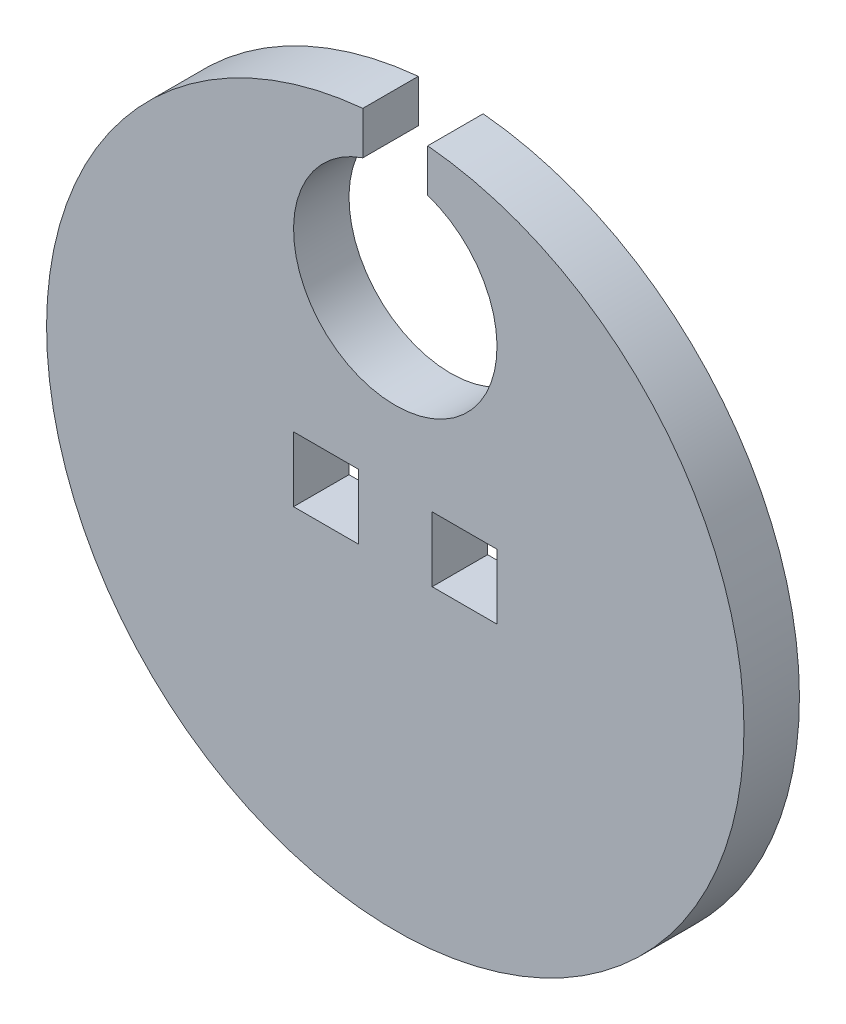
ISO-10303-21;
HEADER;
FILE_DESCRIPTION(('STEP AP214'),'2;1');
FILE_NAME('part.step','',(''),(''),'','','');
FILE_SCHEMA(('AUTOMOTIVE_DESIGN { 1 0 10303 214 1 1 1 1 }'));
ENDSEC;
DATA;
#1=APPLICATION_CONTEXT('core data for automotive mechanical design processes');
#2=APPLICATION_PROTOCOL_DEFINITION('international standard','automotive_design',2000,#1);
#3=PRODUCT_CONTEXT('',#1,'mechanical');
#4=PRODUCT('Part','Part','',(#3));
#5=PRODUCT_RELATED_PRODUCT_CATEGORY('part','',(#4));
#6=PRODUCT_DEFINITION_FORMATION('','',#4);
#7=PRODUCT_DEFINITION_CONTEXT('part definition',#1,'design');
#8=PRODUCT_DEFINITION('design','',#6,#7);
#9=PRODUCT_DEFINITION_SHAPE('','',#8);
#10=(LENGTH_UNIT() NAMED_UNIT(*) SI_UNIT(.MILLI.,.METRE.));
#11=(NAMED_UNIT(*) PLANE_ANGLE_UNIT() SI_UNIT($,.RADIAN.));
#12=(NAMED_UNIT(*) SI_UNIT($,.STERADIAN.) SOLID_ANGLE_UNIT());
#13=UNCERTAINTY_MEASURE_WITH_UNIT(LENGTH_MEASURE(1.E-05),#10,'distance_accuracy_value','');
#14=(GEOMETRIC_REPRESENTATION_CONTEXT(3) GLOBAL_UNCERTAINTY_ASSIGNED_CONTEXT((#13)) GLOBAL_UNIT_ASSIGNED_CONTEXT((#10,
#11,#12)) REPRESENTATION_CONTEXT('',''));
#15=CARTESIAN_POINT('',(0.,0.,0.));
#16=DIRECTION('',(0.,0.,1.));
#17=DIRECTION('',(1.,0.,0.));
#18=AXIS2_PLACEMENT_3D('',#15,#16,#17);
#19=CARTESIAN_POINT('',(0.,-1.4859,2.54));
#20=DIRECTION('',(0.,1.,0.));
#21=DIRECTION('',(0.,0.,1.));
#22=AXIS2_PLACEMENT_3D('',#19,#20,#21);
#23=PLANE('',#22);
#24=DIRECTION('',(1.,0.,0.));
#25=VECTOR('',#24,1.);
#26=CARTESIAN_POINT('',(0.,-1.4859,0.));
#27=LINE('',#26,#25);
#28=CARTESIAN_POINT('',(1.6891,-1.4859,0.));
#29=VERTEX_POINT('',#28);
#30=CARTESIAN_POINT('',(4.6609,-1.4859,0.));
#31=VERTEX_POINT('',#30);
#32=EDGE_CURVE('E164',#29,#31,#27,.T.);
#33=ORIENTED_EDGE('',*,*,#32,.F.);
#34=DIRECTION('',(0.,0.,-1.));
#35=VECTOR('',#34,1.);
#36=CARTESIAN_POINT('',(1.6891,-1.4859,2.54));
#37=LINE('',#36,#35);
#38=CARTESIAN_POINT('',(1.6891,-1.4859,2.54));
#39=VERTEX_POINT('',#38);
#40=EDGE_CURVE('E43',#39,#29,#37,.T.);
#41=ORIENTED_EDGE('',*,*,#40,.F.);
#42=DIRECTION('',(1.,0.,0.));
#43=VECTOR('',#42,1.);
#44=CARTESIAN_POINT('',(0.,-1.4859,2.54));
#45=LINE('',#44,#43);
#46=CARTESIAN_POINT('',(4.6609,-1.4859,2.54));
#47=VERTEX_POINT('',#46);
#48=EDGE_CURVE('E133',#39,#47,#45,.T.);
#49=ORIENTED_EDGE('',*,*,#48,.T.);
#50=DIRECTION('',(0.,0.,-1.));
#51=VECTOR('',#50,1.);
#52=CARTESIAN_POINT('',(4.6609,-1.4859,2.54));
#53=LINE('',#52,#51);
#54=EDGE_CURVE('E59',#47,#31,#53,.T.);
#55=ORIENTED_EDGE('',*,*,#54,.T.);
#56=EDGE_LOOP('',(#33,#41,#49,#55));
#57=FACE_BOUND('',#56,.T.);
#58=ADVANCED_FACE('F35',(#57),#23,.T.);
#59=CARTESIAN_POINT('',(1.6891,0.,2.54));
#60=DIRECTION('',(-1.,0.,0.));
#61=DIRECTION('',(0.,0.,1.));
#62=AXIS2_PLACEMENT_3D('',#59,#60,#61);
#63=PLANE('',#62);
#64=DIRECTION('',(0.,1.,0.));
#65=VECTOR('',#64,1.);
#66=CARTESIAN_POINT('',(1.6891,0.,0.));
#67=LINE('',#66,#65);
#68=CARTESIAN_POINT('',(1.6891,1.4859,0.));
#69=VERTEX_POINT('',#68);
#70=EDGE_CURVE('E138',#29,#69,#67,.T.);
#71=ORIENTED_EDGE('',*,*,#70,.T.);
#72=DIRECTION('',(0.,0.,-1.));
#73=VECTOR('',#72,1.);
#74=CARTESIAN_POINT('',(1.6891,1.4859,2.54));
#75=LINE('',#74,#73);
#76=CARTESIAN_POINT('',(1.6891,1.4859,2.54));
#77=VERTEX_POINT('',#76);
#78=EDGE_CURVE('E122',#77,#69,#75,.T.);
#79=ORIENTED_EDGE('',*,*,#78,.F.);
#80=DIRECTION('',(0.,1.,0.));
#81=VECTOR('',#80,1.);
#82=CARTESIAN_POINT('',(1.6891,0.,2.54));
#83=LINE('',#82,#81);
#84=EDGE_CURVE('E128',#39,#77,#83,.T.);
#85=ORIENTED_EDGE('',*,*,#84,.F.);
#86=ORIENTED_EDGE('',*,*,#40,.T.);
#87=EDGE_LOOP('',(#71,#79,#85,#86));
#88=FACE_BOUND('',#87,.T.);
#89=ADVANCED_FACE('F136',(#88),#63,.F.);
#90=CARTESIAN_POINT('',(0.,1.4859,2.54));
#91=DIRECTION('',(0.,1.,0.));
#92=DIRECTION('',(-1.,0.,0.));
#93=AXIS2_PLACEMENT_3D('',#90,#91,#92);
#94=PLANE('',#93);
#95=DIRECTION('',(1.,0.,0.));
#96=VECTOR('',#95,1.);
#97=CARTESIAN_POINT('',(0.,1.4859,0.));
#98=LINE('',#97,#96);
#99=CARTESIAN_POINT('',(4.6609,1.4859,0.));
#100=VERTEX_POINT('',#99);
#101=EDGE_CURVE('E161',#69,#100,#98,.T.);
#102=ORIENTED_EDGE('',*,*,#101,.T.);
#103=DIRECTION('',(0.,0.,-1.));
#104=VECTOR('',#103,1.);
#105=CARTESIAN_POINT('',(4.6609,1.4859,2.54));
#106=LINE('',#105,#104);
#107=CARTESIAN_POINT('',(4.6609,1.4859,2.54));
#108=VERTEX_POINT('',#107);
#109=EDGE_CURVE('E124',#108,#100,#106,.T.);
#110=ORIENTED_EDGE('',*,*,#109,.F.);
#111=DIRECTION('',(1.,0.,0.));
#112=VECTOR('',#111,1.);
#113=CARTESIAN_POINT('',(0.,1.4859,2.54));
#114=LINE('',#113,#112);
#115=EDGE_CURVE('E117',#77,#108,#114,.T.);
#116=ORIENTED_EDGE('',*,*,#115,.F.);
#117=ORIENTED_EDGE('',*,*,#78,.T.);
#118=EDGE_LOOP('',(#102,#110,#116,#117));
#119=FACE_BOUND('',#118,.T.);
#120=ADVANCED_FACE('F120',(#119),#94,.F.);
#121=CARTESIAN_POINT('',(0.,-1.4859,2.54));
#122=DIRECTION('',(0.,1.,0.));
#123=DIRECTION('',(0.,0.,1.));
#124=AXIS2_PLACEMENT_3D('',#121,#122,#123);
#125=PLANE('',#124);
#126=DIRECTION('',(1.,0.,0.));
#127=VECTOR('',#126,1.);
#128=CARTESIAN_POINT('',(0.,-1.4859,0.));
#129=LINE('',#128,#127);
#130=CARTESIAN_POINT('',(-4.6609,-1.4859,0.));
#131=VERTEX_POINT('',#130);
#132=CARTESIAN_POINT('',(-1.6891,-1.4859,0.));
#133=VERTEX_POINT('',#132);
#134=EDGE_CURVE('E174',#131,#133,#129,.T.);
#135=ORIENTED_EDGE('',*,*,#134,.F.);
#136=DIRECTION('',(0.,0.,-1.));
#137=VECTOR('',#136,1.);
#138=CARTESIAN_POINT('',(-4.6609,-1.4859,2.54));
#139=LINE('',#138,#137);
#140=CARTESIAN_POINT('',(-4.6609,-1.4859,2.54));
#141=VERTEX_POINT('',#140);
#142=EDGE_CURVE('E98',#141,#131,#139,.T.);
#143=ORIENTED_EDGE('',*,*,#142,.F.);
#144=DIRECTION('',(1.,0.,0.));
#145=VECTOR('',#144,1.);
#146=CARTESIAN_POINT('',(0.,-1.4859,2.54));
#147=LINE('',#146,#145);
#148=CARTESIAN_POINT('',(-1.6891,-1.4859,2.54));
#149=VERTEX_POINT('',#148);
#150=EDGE_CURVE('E157',#141,#149,#147,.T.);
#151=ORIENTED_EDGE('',*,*,#150,.T.);
#152=DIRECTION('',(0.,0.,-1.));
#153=VECTOR('',#152,1.);
#154=CARTESIAN_POINT('',(-1.6891,-1.4859,2.54));
#155=LINE('',#154,#153);
#156=EDGE_CURVE('E144',#149,#133,#155,.T.);
#157=ORIENTED_EDGE('',*,*,#156,.T.);
#158=EDGE_LOOP('',(#135,#143,#151,#157));
#159=FACE_BOUND('',#158,.T.);
#160=ADVANCED_FACE('F37',(#159),#125,.T.);
#161=CARTESIAN_POINT('',(-4.6609,0.,2.54));
#162=DIRECTION('',(-1.,0.,0.));
#163=DIRECTION('',(0.,0.,1.));
#164=AXIS2_PLACEMENT_3D('',#161,#162,#163);
#165=PLANE('',#164);
#166=DIRECTION('',(0.,1.,0.));
#167=VECTOR('',#166,1.);
#168=CARTESIAN_POINT('',(-4.6609,0.,0.));
#169=LINE('',#168,#167);
#170=CARTESIAN_POINT('',(-4.6609,1.4859,0.));
#171=VERTEX_POINT('',#170);
#172=EDGE_CURVE('E172',#131,#171,#169,.T.);
#173=ORIENTED_EDGE('',*,*,#172,.T.);
#174=DIRECTION('',(0.,0.,-1.));
#175=VECTOR('',#174,1.);
#176=CARTESIAN_POINT('',(-4.6609,1.4859,2.54));
#177=LINE('',#176,#175);
#178=CARTESIAN_POINT('',(-4.6609,1.4859,2.54));
#179=VERTEX_POINT('',#178);
#180=EDGE_CURVE('E149',#179,#171,#177,.T.);
#181=ORIENTED_EDGE('',*,*,#180,.F.);
#182=DIRECTION('',(0.,1.,0.));
#183=VECTOR('',#182,1.);
#184=CARTESIAN_POINT('',(-4.6609,0.,2.54));
#185=LINE('',#184,#183);
#186=EDGE_CURVE('E187',#141,#179,#185,.T.);
#187=ORIENTED_EDGE('',*,*,#186,.F.);
#188=ORIENTED_EDGE('',*,*,#142,.T.);
#189=EDGE_LOOP('',(#173,#181,#187,#188));
#190=FACE_BOUND('',#189,.T.);
#191=ADVANCED_FACE('F266',(#190),#165,.F.);
#192=CARTESIAN_POINT('',(0.,1.4859,2.54));
#193=DIRECTION('',(0.,1.,0.));
#194=DIRECTION('',(-1.,0.,0.));
#195=AXIS2_PLACEMENT_3D('',#192,#193,#194);
#196=PLANE('',#195);
#197=DIRECTION('',(1.,0.,0.));
#198=VECTOR('',#197,1.);
#199=CARTESIAN_POINT('',(0.,1.4859,0.));
#200=LINE('',#199,#198);
#201=CARTESIAN_POINT('',(-1.6891,1.4859,0.));
#202=VERTEX_POINT('',#201);
#203=EDGE_CURVE('E169',#171,#202,#200,.T.);
#204=ORIENTED_EDGE('',*,*,#203,.T.);
#205=DIRECTION('',(0.,0.,-1.));
#206=VECTOR('',#205,1.);
#207=CARTESIAN_POINT('',(-1.6891,1.4859,2.54));
#208=LINE('',#207,#206);
#209=CARTESIAN_POINT('',(-1.6891,1.4859,2.54));
#210=VERTEX_POINT('',#209);
#211=EDGE_CURVE('E146',#210,#202,#208,.T.);
#212=ORIENTED_EDGE('',*,*,#211,.F.);
#213=DIRECTION('',(1.,0.,0.));
#214=VECTOR('',#213,1.);
#215=CARTESIAN_POINT('',(0.,1.4859,2.54));
#216=LINE('',#215,#214);
#217=EDGE_CURVE('E185',#179,#210,#216,.T.);
#218=ORIENTED_EDGE('',*,*,#217,.F.);
#219=ORIENTED_EDGE('',*,*,#180,.T.);
#220=EDGE_LOOP('',(#204,#212,#218,#219));
#221=FACE_BOUND('',#220,.T.);
#222=ADVANCED_FACE('F264',(#221),#196,.F.);
#223=CARTESIAN_POINT('',(4.6609,0.,2.54));
#224=DIRECTION('',(-1.,0.,0.));
#225=DIRECTION('',(0.,0.,1.));
#226=AXIS2_PLACEMENT_3D('',#223,#224,#225);
#227=PLANE('',#226);
#228=DIRECTION('',(0.,1.,0.));
#229=VECTOR('',#228,1.);
#230=CARTESIAN_POINT('',(4.6609,0.,0.));
#231=LINE('',#230,#229);
#232=EDGE_CURVE('E158',#31,#100,#231,.T.);
#233=ORIENTED_EDGE('',*,*,#232,.F.);
#234=ORIENTED_EDGE('',*,*,#54,.F.);
#235=DIRECTION('',(0.,1.,0.));
#236=VECTOR('',#235,1.);
#237=CARTESIAN_POINT('',(4.6609,0.,2.54));
#238=LINE('',#237,#236);
#239=EDGE_CURVE('E127',#47,#108,#238,.T.);
#240=ORIENTED_EDGE('',*,*,#239,.T.);
#241=ORIENTED_EDGE('',*,*,#109,.T.);
#242=EDGE_LOOP('',(#233,#234,#240,#241));
#243=FACE_BOUND('',#242,.T.);
#244=ADVANCED_FACE('F262',(#243),#227,.T.);
#245=CARTESIAN_POINT('',(-1.6891,0.,2.54));
#246=DIRECTION('',(-1.,0.,0.));
#247=DIRECTION('',(0.,-1.,0.));
#248=AXIS2_PLACEMENT_3D('',#245,#246,#247);
#249=PLANE('',#248);
#250=DIRECTION('',(0.,1.,0.));
#251=VECTOR('',#250,1.);
#252=CARTESIAN_POINT('',(-1.6891,0.,0.));
#253=LINE('',#252,#251);
#254=EDGE_CURVE('E166',#133,#202,#253,.T.);
#255=ORIENTED_EDGE('',*,*,#254,.F.);
#256=ORIENTED_EDGE('',*,*,#156,.F.);
#257=DIRECTION('',(0.,1.,0.));
#258=VECTOR('',#257,1.);
#259=CARTESIAN_POINT('',(-1.6891,0.,2.54));
#260=LINE('',#259,#258);
#261=EDGE_CURVE('E182',#149,#210,#260,.T.);
#262=ORIENTED_EDGE('',*,*,#261,.T.);
#263=ORIENTED_EDGE('',*,*,#211,.T.);
#264=EDGE_LOOP('',(#255,#256,#262,#263));
#265=FACE_BOUND('',#264,.T.);
#266=ADVANCED_FACE('F259',(#265),#249,.T.);
#267=CARTESIAN_POINT('',(0.,0.,2.54));
#268=DIRECTION('',(0.,0.,-1.));
#269=DIRECTION('',(-1.,0.,0.));
#270=AXIS2_PLACEMENT_3D('',#267,#268,#269);
#271=CYLINDRICAL_SURFACE('',#270,15.9766);
#272=CARTESIAN_POINT('',(0.,0.,2.54));
#273=DIRECTION('',(0.,0.,1.));
#274=DIRECTION('',(1.,0.,0.));
#275=AXIS2_PLACEMENT_3D('',#272,#273,#274);
#276=CIRCLE('',#275,15.9766);
#277=CARTESIAN_POINT('',(-1.4859,15.9073520345154,2.54));
#278=VERTEX_POINT('',#277);
#279=CARTESIAN_POINT('',(1.4859,15.9073520345154,2.54));
#280=VERTEX_POINT('',#279);
#281=EDGE_CURVE('E147',#278,#280,#276,.T.);
#282=ORIENTED_EDGE('',*,*,#281,.F.);
#283=DIRECTION('',(0.,0.,-1.));
#284=VECTOR('',#283,1.);
#285=CARTESIAN_POINT('',(-1.4859,15.9073520345154,2.54));
#286=LINE('',#285,#284);
#287=CARTESIAN_POINT('',(-1.4859,15.9073520345154,0.));
#288=VERTEX_POINT('',#287);
#289=EDGE_CURVE('E177',#278,#288,#286,.T.);
#290=ORIENTED_EDGE('',*,*,#289,.T.);
#291=CARTESIAN_POINT('',(0.,0.,0.));
#292=DIRECTION('',(0.,0.,1.));
#293=DIRECTION('',(1.,0.,0.));
#294=AXIS2_PLACEMENT_3D('',#291,#292,#293);
#295=CIRCLE('',#294,15.9766);
#296=CARTESIAN_POINT('',(1.4859,15.9073520345154,0.));
#297=VERTEX_POINT('',#296);
#298=EDGE_CURVE('E154',#288,#297,#295,.T.);
#299=ORIENTED_EDGE('',*,*,#298,.T.);
#300=DIRECTION('',(0.,0.,-1.));
#301=VECTOR('',#300,1.);
#302=CARTESIAN_POINT('',(1.4859,15.9073520345154,2.54));
#303=LINE('',#302,#301);
#304=EDGE_CURVE('E50',#297,#280,#303,.F.);
#305=ORIENTED_EDGE('',*,*,#304,.T.);
#306=EDGE_LOOP('',(#282,#290,#299,#305));
#307=FACE_BOUND('',#306,.T.);
#308=ADVANCED_FACE('F238',(#307),#271,.T.);
#309=CARTESIAN_POINT('',(0.,0.,2.54));
#310=DIRECTION('',(0.,0.,1.));
#311=DIRECTION('',(1.,0.,0.));
#312=AXIS2_PLACEMENT_3D('',#309,#310,#311);
#313=PLANE('',#312);
#314=DIRECTION('',(0.,-1.,0.));
#315=VECTOR('',#314,1.);
#316=CARTESIAN_POINT('',(-1.4859,13.9427018912552,2.54));
#317=LINE('',#316,#315);
#318=CARTESIAN_POINT('',(-1.4859,13.9427018912552,2.54));
#319=VERTEX_POINT('',#318);
#320=EDGE_CURVE('E200',#278,#319,#317,.T.);
#321=ORIENTED_EDGE('',*,*,#320,.F.);
#322=ORIENTED_EDGE('',*,*,#281,.T.);
#323=DIRECTION('',(0.,1.,0.));
#324=VECTOR('',#323,1.);
#325=CARTESIAN_POINT('',(1.4859,18.9484,2.54));
#326=LINE('',#325,#324);
#327=CARTESIAN_POINT('',(1.4859,13.9427018912552,2.54));
#328=VERTEX_POINT('',#327);
#329=EDGE_CURVE('E204',#328,#280,#326,.T.);
#330=ORIENTED_EDGE('',*,*,#329,.F.);
#331=CARTESIAN_POINT('',(0.,9.525,2.54));
#332=DIRECTION('',(0.,0.,1.));
#333=DIRECTION('',(1.,0.,0.));
#334=AXIS2_PLACEMENT_3D('',#331,#332,#333);
#335=CIRCLE('',#334,4.6609);
#336=EDGE_CURVE('E206',#319,#328,#335,.T.);
#337=ORIENTED_EDGE('',*,*,#336,.F.);
#338=EDGE_LOOP('',(#321,#322,#330,#337));
#339=FACE_BOUND('',#338,.T.);
#340=ORIENTED_EDGE('',*,*,#150,.F.);
#341=ORIENTED_EDGE('',*,*,#186,.T.);
#342=ORIENTED_EDGE('',*,*,#217,.T.);
#343=ORIENTED_EDGE('',*,*,#261,.F.);
#344=EDGE_LOOP('',(#340,#341,#342,#343));
#345=FACE_BOUND('',#344,.T.);
#346=ORIENTED_EDGE('',*,*,#48,.F.);
#347=ORIENTED_EDGE('',*,*,#84,.T.);
#348=ORIENTED_EDGE('',*,*,#115,.T.);
#349=ORIENTED_EDGE('',*,*,#239,.F.);
#350=EDGE_LOOP('',(#346,#347,#348,#349));
#351=FACE_BOUND('',#350,.T.);
#352=ADVANCED_FACE('F132',(#339,#345,#351),#313,.T.);
#353=CARTESIAN_POINT('',(0.,0.,0.));
#354=DIRECTION('',(0.,0.,1.));
#355=DIRECTION('',(1.,0.,0.));
#356=AXIS2_PLACEMENT_3D('',#353,#354,#355);
#357=PLANE('',#356);
#358=ORIENTED_EDGE('',*,*,#134,.T.);
#359=ORIENTED_EDGE('',*,*,#254,.T.);
#360=ORIENTED_EDGE('',*,*,#203,.F.);
#361=ORIENTED_EDGE('',*,*,#172,.F.);
#362=EDGE_LOOP('',(#358,#359,#360,#361));
#363=FACE_BOUND('',#362,.T.);
#364=ORIENTED_EDGE('',*,*,#32,.T.);
#365=ORIENTED_EDGE('',*,*,#232,.T.);
#366=ORIENTED_EDGE('',*,*,#101,.F.);
#367=ORIENTED_EDGE('',*,*,#70,.F.);
#368=EDGE_LOOP('',(#364,#365,#366,#367));
#369=FACE_BOUND('',#368,.T.);
#370=ORIENTED_EDGE('',*,*,#298,.F.);
#371=DIRECTION('',(0.,-1.,0.));
#372=VECTOR('',#371,1.);
#373=CARTESIAN_POINT('',(-1.4859,0.,0.));
#374=LINE('',#373,#372);
#375=CARTESIAN_POINT('',(-1.4859,13.9427018912552,0.));
#376=VERTEX_POINT('',#375);
#377=EDGE_CURVE('E11',#288,#376,#374,.T.);
#378=ORIENTED_EDGE('',*,*,#377,.T.);
#379=CARTESIAN_POINT('',(0.,9.525,0.));
#380=DIRECTION('',(0.,0.,1.));
#381=DIRECTION('',(1.,0.,0.));
#382=AXIS2_PLACEMENT_3D('',#379,#380,#381);
#383=CIRCLE('',#382,4.6609);
#384=CARTESIAN_POINT('',(1.4859,13.9427018912552,0.));
#385=VERTEX_POINT('',#384);
#386=EDGE_CURVE('E203',#376,#385,#383,.T.);
#387=ORIENTED_EDGE('',*,*,#386,.T.);
#388=DIRECTION('',(0.,1.,0.));
#389=VECTOR('',#388,1.);
#390=CARTESIAN_POINT('',(1.4859,18.9484,0.));
#391=LINE('',#390,#389);
#392=EDGE_CURVE('E197',#385,#297,#391,.T.);
#393=ORIENTED_EDGE('',*,*,#392,.T.);
#394=EDGE_LOOP('',(#370,#378,#387,#393));
#395=FACE_BOUND('',#394,.T.);
#396=ADVANCED_FACE('F215',(#363,#369,#395),#357,.F.);
#397=CARTESIAN_POINT('',(-1.4859,13.9427018912552,0.));
#398=DIRECTION('',(-1.,0.,0.));
#399=DIRECTION('',(0.,0.,1.));
#400=AXIS2_PLACEMENT_3D('',#397,#398,#399);
#401=PLANE('',#400);
#402=ORIENTED_EDGE('',*,*,#320,.T.);
#403=DIRECTION('',(0.,0.,1.));
#404=VECTOR('',#403,1.);
#405=CARTESIAN_POINT('',(-1.4859,13.9427018912552,0.));
#406=LINE('',#405,#404);
#407=EDGE_CURVE('E193',#376,#319,#406,.T.);
#408=ORIENTED_EDGE('',*,*,#407,.F.);
#409=ORIENTED_EDGE('',*,*,#377,.F.);
#410=ORIENTED_EDGE('',*,*,#289,.F.);
#411=EDGE_LOOP('',(#402,#408,#409,#410));
#412=FACE_BOUND('',#411,.T.);
#413=ADVANCED_FACE('F235',(#412),#401,.F.);
#414=CARTESIAN_POINT('',(1.4859,18.9484,0.));
#415=DIRECTION('',(1.,0.,0.));
#416=DIRECTION('',(0.,0.,-1.));
#417=AXIS2_PLACEMENT_3D('',#414,#415,#416);
#418=PLANE('',#417);
#419=ORIENTED_EDGE('',*,*,#392,.F.);
#420=DIRECTION('',(0.,0.,1.));
#421=VECTOR('',#420,1.);
#422=CARTESIAN_POINT('',(1.4859,13.9427018912552,0.));
#423=LINE('',#422,#421);
#424=EDGE_CURVE('E194',#385,#328,#423,.T.);
#425=ORIENTED_EDGE('',*,*,#424,.T.);
#426=ORIENTED_EDGE('',*,*,#329,.T.);
#427=ORIENTED_EDGE('',*,*,#304,.F.);
#428=EDGE_LOOP('',(#419,#425,#426,#427));
#429=FACE_BOUND('',#428,.T.);
#430=ADVANCED_FACE('F242',(#429),#418,.F.);
#431=CARTESIAN_POINT('',(0.,9.525,0.));
#432=DIRECTION('',(0.,0.,1.));
#433=DIRECTION('',(1.,0.,0.));
#434=AXIS2_PLACEMENT_3D('',#431,#432,#433);
#435=CYLINDRICAL_SURFACE('',#434,4.6609);
#436=ORIENTED_EDGE('',*,*,#336,.T.);
#437=ORIENTED_EDGE('',*,*,#424,.F.);
#438=ORIENTED_EDGE('',*,*,#386,.F.);
#439=ORIENTED_EDGE('',*,*,#407,.T.);
#440=EDGE_LOOP('',(#436,#437,#438,#439));
#441=FACE_BOUND('',#440,.T.);
#442=ADVANCED_FACE('F222',(#441),#435,.F.);
#443=CLOSED_SHELL('',(#58,#89,#120,#160,#191,#222,#244,#266,#308,#352,#396,#413,#430,#442));
#444=MANIFOLD_SOLID_BREP('B2',#443);
#445=ADVANCED_BREP_SHAPE_REPRESENTATION('',(#18,#444),#14);
#446=SHAPE_DEFINITION_REPRESENTATION(#9,#445);
ENDSEC;
END-ISO-10303-21;
